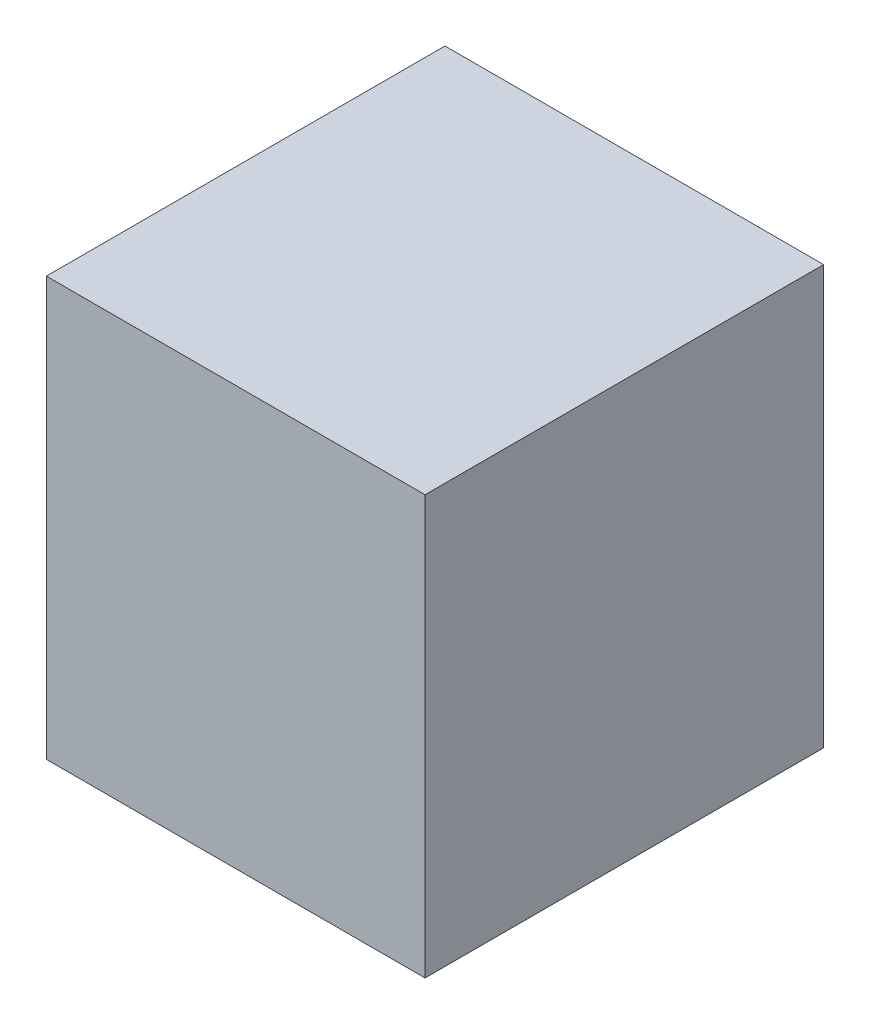
ISO-10303-21;
HEADER;
FILE_DESCRIPTION(('STEP AP214'),'2;1');
FILE_NAME('part.step','',(''),(''),'','','');
FILE_SCHEMA(('AUTOMOTIVE_DESIGN { 1 0 10303 214 1 1 1 1 }'));
ENDSEC;
DATA;
#1=APPLICATION_CONTEXT('core data for automotive mechanical design processes');
#2=APPLICATION_PROTOCOL_DEFINITION('international standard','automotive_design',2000,#1);
#3=PRODUCT_CONTEXT('',#1,'mechanical');
#4=PRODUCT('Part','Part','',(#3));
#5=PRODUCT_RELATED_PRODUCT_CATEGORY('part','',(#4));
#6=PRODUCT_DEFINITION_FORMATION('','',#4);
#7=PRODUCT_DEFINITION_CONTEXT('part definition',#1,'design');
#8=PRODUCT_DEFINITION('design','',#6,#7);
#9=PRODUCT_DEFINITION_SHAPE('','',#8);
#10=(LENGTH_UNIT() NAMED_UNIT(*) SI_UNIT(.MILLI.,.METRE.));
#11=(NAMED_UNIT(*) PLANE_ANGLE_UNIT() SI_UNIT($,.RADIAN.));
#12=(NAMED_UNIT(*) SI_UNIT($,.STERADIAN.) SOLID_ANGLE_UNIT());
#13=UNCERTAINTY_MEASURE_WITH_UNIT(LENGTH_MEASURE(1.E-05),#10,'distance_accuracy_value','');
#14=(GEOMETRIC_REPRESENTATION_CONTEXT(3) GLOBAL_UNCERTAINTY_ASSIGNED_CONTEXT((#13)) GLOBAL_UNIT_ASSIGNED_CONTEXT((#10,
#11,#12)) REPRESENTATION_CONTEXT('',''));
#15=CARTESIAN_POINT('',(0.,0.,0.));
#16=DIRECTION('',(0.,0.,1.));
#17=DIRECTION('',(1.,0.,0.));
#18=AXIS2_PLACEMENT_3D('',#15,#16,#17);
#19=CARTESIAN_POINT('',(-0.47499778,0.52500022,0.));
#20=DIRECTION('',(1.,0.,0.));
#21=DIRECTION('',(0.,0.,-1.));
#22=AXIS2_PLACEMENT_3D('',#19,#20,#21);
#23=PLANE('',#22);
#24=DIRECTION('',(0.,0.,1.));
#25=VECTOR('',#24,1.);
#26=CARTESIAN_POINT('',(-0.47499778,-0.52500022,0.));
#27=LINE('',#26,#25);
#28=CARTESIAN_POINT('',(-0.47499778,-0.52500022,0.));
#29=VERTEX_POINT('',#28);
#30=CARTESIAN_POINT('',(-0.47499778,-0.52500022,1.00000054));
#31=VERTEX_POINT('',#30);
#32=EDGE_CURVE('E20',#29,#31,#27,.T.);
#33=ORIENTED_EDGE('',*,*,#32,.T.);
#34=DIRECTION('',(0.,1.,0.));
#35=VECTOR('',#34,1.);
#36=CARTESIAN_POINT('',(-0.47499778,-0.52500022,1.00000054));
#37=LINE('',#36,#35);
#38=CARTESIAN_POINT('',(-0.47499778,0.52500022,1.00000054));
#39=VERTEX_POINT('',#38);
#40=EDGE_CURVE('E55',#31,#39,#37,.T.);
#41=ORIENTED_EDGE('',*,*,#40,.T.);
#42=DIRECTION('',(0.,0.,-1.));
#43=VECTOR('',#42,1.);
#44=CARTESIAN_POINT('',(-0.47499778,0.52500022,0.));
#45=LINE('',#44,#43);
#46=CARTESIAN_POINT('',(-0.47499778,0.52500022,0.));
#47=VERTEX_POINT('',#46);
#48=EDGE_CURVE('E74',#39,#47,#45,.T.);
#49=ORIENTED_EDGE('',*,*,#48,.T.);
#50=DIRECTION('',(0.,1.,0.));
#51=VECTOR('',#50,1.);
#52=CARTESIAN_POINT('',(-0.47499778,-0.52500022,0.));
#53=LINE('',#52,#51);
#54=EDGE_CURVE('E66',#29,#47,#53,.T.);
#55=ORIENTED_EDGE('',*,*,#54,.F.);
#56=EDGE_LOOP('',(#33,#41,#49,#55));
#57=FACE_BOUND('',#56,.T.);
#58=ADVANCED_FACE('F17',(#57),#23,.F.);
#59=CARTESIAN_POINT('',(-0.47499778,-0.52500022,0.));
#60=DIRECTION('',(0.,1.,0.));
#61=DIRECTION('',(0.,0.,1.));
#62=AXIS2_PLACEMENT_3D('',#59,#60,#61);
#63=PLANE('',#62);
#64=DIRECTION('',(0.,0.,1.));
#65=VECTOR('',#64,1.);
#66=CARTESIAN_POINT('',(0.47500032,-0.52500022,0.));
#67=LINE('',#66,#65);
#68=CARTESIAN_POINT('',(0.47500032,-0.52500022,0.));
#69=VERTEX_POINT('',#68);
#70=CARTESIAN_POINT('',(0.47500032,-0.52500022,1.00000054));
#71=VERTEX_POINT('',#70);
#72=EDGE_CURVE('E72',#69,#71,#67,.T.);
#73=ORIENTED_EDGE('',*,*,#72,.T.);
#74=DIRECTION('',(-1.,0.,0.));
#75=VECTOR('',#74,1.);
#76=CARTESIAN_POINT('',(-0.47499778,-0.52500022,1.00000054));
#77=LINE('',#76,#75);
#78=EDGE_CURVE('E62',#71,#31,#77,.T.);
#79=ORIENTED_EDGE('',*,*,#78,.T.);
#80=ORIENTED_EDGE('',*,*,#32,.F.);
#81=DIRECTION('',(-1.,0.,0.));
#82=VECTOR('',#81,1.);
#83=CARTESIAN_POINT('',(-0.47499778,-0.52500022,0.));
#84=LINE('',#83,#82);
#85=EDGE_CURVE('E80',#69,#29,#84,.T.);
#86=ORIENTED_EDGE('',*,*,#85,.F.);
#87=EDGE_LOOP('',(#73,#79,#80,#86));
#88=FACE_BOUND('',#87,.T.);
#89=ADVANCED_FACE('F71',(#88),#63,.F.);
#90=CARTESIAN_POINT('',(-0.47499778,-0.52500022,1.00000054));
#91=DIRECTION('',(0.,0.,-1.));
#92=DIRECTION('',(-1.,0.,0.));
#93=AXIS2_PLACEMENT_3D('',#90,#91,#92);
#94=PLANE('',#93);
#95=DIRECTION('',(0.,1.,0.));
#96=VECTOR('',#95,1.);
#97=CARTESIAN_POINT('',(0.47500032,-0.52500022,1.00000054));
#98=LINE('',#97,#96);
#99=CARTESIAN_POINT('',(0.47500032,0.52500022,1.00000054));
#100=VERTEX_POINT('',#99);
#101=EDGE_CURVE('E83',#71,#100,#98,.T.);
#102=ORIENTED_EDGE('',*,*,#101,.T.);
#103=DIRECTION('',(1.,0.,0.));
#104=VECTOR('',#103,1.);
#105=CARTESIAN_POINT('',(0.47500032,0.52500022,1.00000054));
#106=LINE('',#105,#104);
#107=EDGE_CURVE('E64',#100,#39,#106,.F.);
#108=ORIENTED_EDGE('',*,*,#107,.T.);
#109=ORIENTED_EDGE('',*,*,#40,.F.);
#110=ORIENTED_EDGE('',*,*,#78,.F.);
#111=EDGE_LOOP('',(#102,#108,#109,#110));
#112=FACE_BOUND('',#111,.T.);
#113=ADVANCED_FACE('F60',(#112),#94,.F.);
#114=CARTESIAN_POINT('',(0.47500032,0.52500022,0.));
#115=DIRECTION('',(0.,-1.,0.));
#116=DIRECTION('',(0.,0.,-1.));
#117=AXIS2_PLACEMENT_3D('',#114,#115,#116);
#118=PLANE('',#117);
#119=ORIENTED_EDGE('',*,*,#48,.F.);
#120=ORIENTED_EDGE('',*,*,#107,.F.);
#121=DIRECTION('',(0.,0.,1.));
#122=VECTOR('',#121,1.);
#123=CARTESIAN_POINT('',(0.47500032,0.52500022,0.));
#124=LINE('',#123,#122);
#125=CARTESIAN_POINT('',(0.47500032,0.52500022,0.));
#126=VERTEX_POINT('',#125);
#127=EDGE_CURVE('E26',#100,#126,#124,.F.);
#128=ORIENTED_EDGE('',*,*,#127,.T.);
#129=DIRECTION('',(-1.,0.,0.));
#130=VECTOR('',#129,1.);
#131=CARTESIAN_POINT('',(-0.47499778,0.52500022,0.));
#132=LINE('',#131,#130);
#133=EDGE_CURVE('E34',#47,#126,#132,.F.);
#134=ORIENTED_EDGE('',*,*,#133,.F.);
#135=EDGE_LOOP('',(#119,#120,#128,#134));
#136=FACE_BOUND('',#135,.T.);
#137=ADVANCED_FACE('F88',(#136),#118,.F.);
#138=CARTESIAN_POINT('',(-0.47499778,-0.52500022,0.));
#139=DIRECTION('',(0.,0.,-1.));
#140=DIRECTION('',(-1.,0.,0.));
#141=AXIS2_PLACEMENT_3D('',#138,#139,#140);
#142=PLANE('',#141);
#143=DIRECTION('',(0.,1.,0.));
#144=VECTOR('',#143,1.);
#145=CARTESIAN_POINT('',(0.47500032,-0.52500022,0.));
#146=LINE('',#145,#144);
#147=EDGE_CURVE('E11',#126,#69,#146,.F.);
#148=ORIENTED_EDGE('',*,*,#147,.T.);
#149=ORIENTED_EDGE('',*,*,#85,.T.);
#150=ORIENTED_EDGE('',*,*,#54,.T.);
#151=ORIENTED_EDGE('',*,*,#133,.T.);
#152=EDGE_LOOP('',(#148,#149,#150,#151));
#153=FACE_BOUND('',#152,.T.);
#154=ADVANCED_FACE('F91',(#153),#142,.T.);
#155=CARTESIAN_POINT('',(0.47500032,-0.52500022,0.));
#156=DIRECTION('',(-1.,0.,0.));
#157=DIRECTION('',(0.,0.,1.));
#158=AXIS2_PLACEMENT_3D('',#155,#156,#157);
#159=PLANE('',#158);
#160=ORIENTED_EDGE('',*,*,#127,.F.);
#161=ORIENTED_EDGE('',*,*,#101,.F.);
#162=ORIENTED_EDGE('',*,*,#72,.F.);
#163=ORIENTED_EDGE('',*,*,#147,.F.);
#164=EDGE_LOOP('',(#160,#161,#162,#163));
#165=FACE_BOUND('',#164,.T.);
#166=ADVANCED_FACE('F90',(#165),#159,.F.);
#167=CLOSED_SHELL('',(#58,#89,#113,#137,#154,#166));
#168=MANIFOLD_SOLID_BREP('B1',#167);
#169=ADVANCED_BREP_SHAPE_REPRESENTATION('',(#18,#168),#14);
#170=SHAPE_DEFINITION_REPRESENTATION(#9,#169);
ENDSEC;
END-ISO-10303-21;
